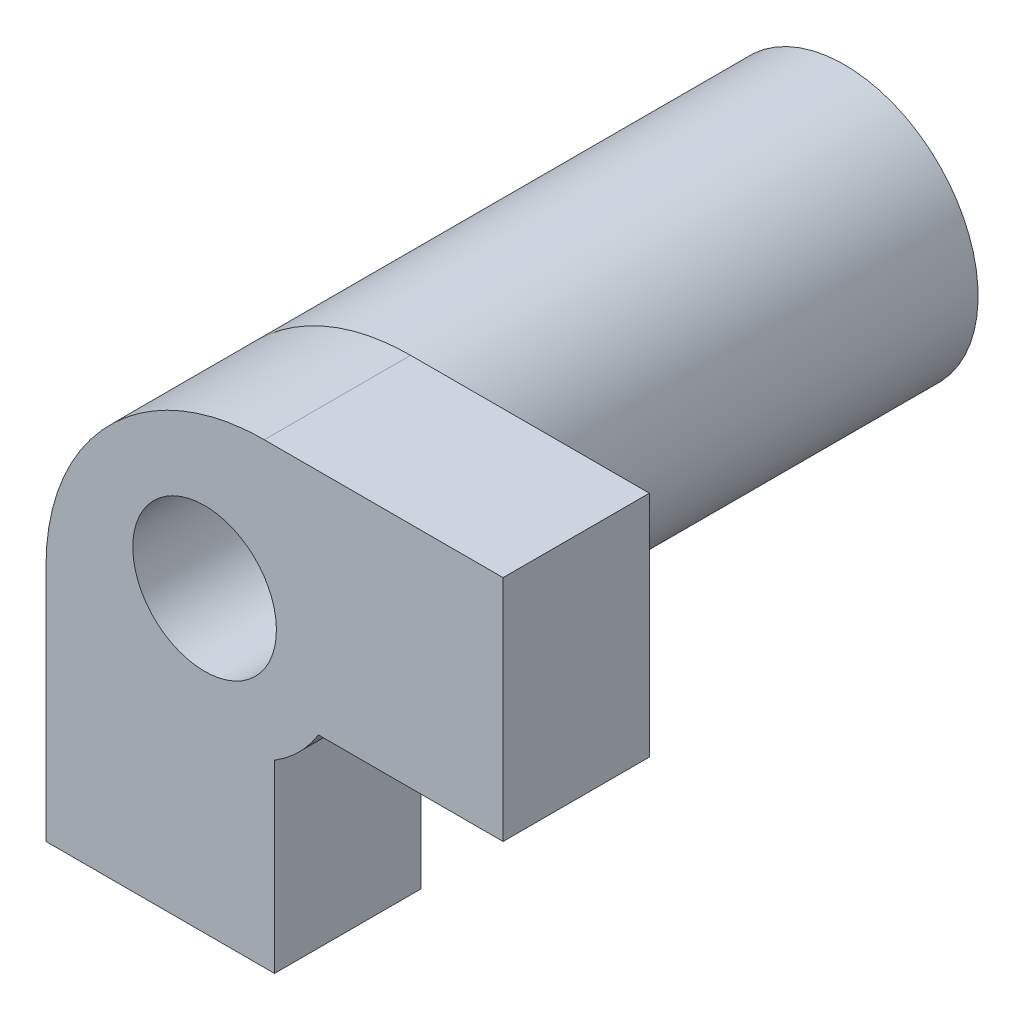
ISO-10303-21;
HEADER;
FILE_DESCRIPTION(('STEP AP214'),'2;1');
FILE_NAME('part.step','',(''),(''),'','','');
FILE_SCHEMA(('AUTOMOTIVE_DESIGN { 1 0 10303 214 1 1 1 1 }'));
ENDSEC;
DATA;
#1=APPLICATION_CONTEXT('core data for automotive mechanical design processes');
#2=APPLICATION_PROTOCOL_DEFINITION('international standard','automotive_design',2000,#1);
#3=PRODUCT_CONTEXT('',#1,'mechanical');
#4=PRODUCT('Part','Part','',(#3));
#5=PRODUCT_RELATED_PRODUCT_CATEGORY('part','',(#4));
#6=PRODUCT_DEFINITION_FORMATION('','',#4);
#7=PRODUCT_DEFINITION_CONTEXT('part definition',#1,'design');
#8=PRODUCT_DEFINITION('design','',#6,#7);
#9=PRODUCT_DEFINITION_SHAPE('','',#8);
#10=(LENGTH_UNIT() NAMED_UNIT(*) SI_UNIT(.MILLI.,.METRE.));
#11=(NAMED_UNIT(*) PLANE_ANGLE_UNIT() SI_UNIT($,.RADIAN.));
#12=(NAMED_UNIT(*) SI_UNIT($,.STERADIAN.) SOLID_ANGLE_UNIT());
#13=UNCERTAINTY_MEASURE_WITH_UNIT(LENGTH_MEASURE(1.E-05),#10,'distance_accuracy_value','');
#14=(GEOMETRIC_REPRESENTATION_CONTEXT(3) GLOBAL_UNCERTAINTY_ASSIGNED_CONTEXT((#13)) GLOBAL_UNIT_ASSIGNED_CONTEXT((#10,
#11,#12)) REPRESENTATION_CONTEXT('',''));
#15=CARTESIAN_POINT('',(0.,0.,0.));
#16=DIRECTION('',(0.,0.,1.));
#17=DIRECTION('',(1.,0.,0.));
#18=AXIS2_PLACEMENT_3D('',#15,#16,#17);
#19=CARTESIAN_POINT('',(0.,0.,0.));
#20=DIRECTION('',(0.,0.,1.));
#21=DIRECTION('',(1.,0.,0.));
#22=AXIS2_PLACEMENT_3D('',#19,#20,#21);
#23=PLANE('',#22);
#24=DIRECTION('',(0.,1.,0.));
#25=VECTOR('',#24,1.);
#26=CARTESIAN_POINT('',(6.54715186755524,0.,0.));
#27=LINE('',#26,#25);
#28=CARTESIAN_POINT('',(6.54715186755524,-1.53021253775997,0.));
#29=VERTEX_POINT('',#28);
#30=CARTESIAN_POINT('',(6.54715186755524,3.46978746224003,0.));
#31=VERTEX_POINT('',#30);
#32=EDGE_CURVE('E138',#29,#31,#27,.T.);
#33=ORIENTED_EDGE('',*,*,#32,.F.);
#34=DIRECTION('',(1.,0.,0.));
#35=VECTOR('',#34,1.);
#36=CARTESIAN_POINT('',(13.4404110884823,-1.53021253775997,0.));
#37=LINE('',#36,#35);
#38=CARTESIAN_POINT('',(2.50685643906458,-1.53021253775997,0.));
#39=VERTEX_POINT('',#38);
#40=EDGE_CURVE('E125',#39,#29,#37,.T.);
#41=ORIENTED_EDGE('',*,*,#40,.F.);
#42=CARTESIAN_POINT('',(0.0167410675553092,0.,0.));
#43=DIRECTION('',(0.,0.,-1.));
#44=DIRECTION('',(-1.,0.,0.));
#45=AXIS2_PLACEMENT_3D('',#42,#43,#44);
#46=CIRCLE('',#45,2.92270849968733);
#47=CARTESIAN_POINT('',(-2.05006791804164,2.06652500376846,0.));
#48=VERTEX_POINT('',#47);
#49=EDGE_CURVE('E137',#48,#39,#46,.T.);
#50=ORIENTED_EDGE('',*,*,#49,.F.);
#51=CARTESIAN_POINT('',(-3.45284813244476,-1.30644903047994,0.));
#52=CARTESIAN_POINT('',(-3.45284813244476,1.32052564952012,0.));
#53=CARTESIAN_POINT('',(-1.30348718860465,3.46978746224003,0.));
#54=CARTESIAN_POINT('',(1.32338836027532,3.46978746224003,0.));
#55=B_SPLINE_CURVE_WITH_KNOTS('',3,(#51,#52,#53,#54),.UNSPECIFIED.,.F.,.F.,(4,4),
(0.777777777777778,1.),.UNSPECIFIED.);
#56=CARTESIAN_POINT('',(1.32338836027532,3.46978746224003,0.));
#57=VERTEX_POINT('',#56);
#58=EDGE_CURVE('E91',#48,#57,#55,.T.);
#59=ORIENTED_EDGE('',*,*,#58,.T.);
#60=DIRECTION('',(1.,0.,0.));
#61=VECTOR('',#60,1.);
#62=CARTESIAN_POINT('',(0.,3.46978746224003,0.));
#63=LINE('',#62,#61);
#64=EDGE_CURVE('E160',#57,#31,#63,.T.);
#65=ORIENTED_EDGE('',*,*,#64,.T.);
#66=EDGE_LOOP('',(#33,#41,#50,#59,#65));
#67=FACE_BOUND('',#66,.T.);
#68=ADVANCED_FACE('F42',(#67),#23,.F.);
#69=CARTESIAN_POINT('',(-3.45284813244476,-1.30644903047994,3.2));
#70=CARTESIAN_POINT('',(-3.45284813244476,1.32052564952012,3.2));
#71=CARTESIAN_POINT('',(-1.30348718860465,3.46978746224003,3.2));
#72=CARTESIAN_POINT('',(1.32338836027532,3.46978746224003,3.2));
#73=B_SPLINE_CURVE_WITH_KNOTS('',3,(#69,#70,#71,#72),.UNSPECIFIED.,.F.,.F.,(4,4),
(0.777777777777778,1.),.UNSPECIFIED.);
#74=DIRECTION('',(0.,0.,-1.));
#75=VECTOR('',#74,1.);
#76=SURFACE_OF_LINEAR_EXTRUSION('',#73,#75);
#77=CARTESIAN_POINT('',(-3.45284813244476,-1.30644903047994,0.));
#78=VERTEX_POINT('',#77);
#79=EDGE_CURVE('E182',#78,#48,#55,.T.);
#80=ORIENTED_EDGE('',*,*,#79,.F.);
#81=DIRECTION('',(0.,0.,-1.));
#82=VECTOR('',#81,1.);
#83=CARTESIAN_POINT('',(-3.45284813244476,-1.30644903047994,3.2));
#84=LINE('',#83,#82);
#85=CARTESIAN_POINT('',(-3.45284813244476,-1.30644903047994,3.2));
#86=VERTEX_POINT('',#85);
#87=EDGE_CURVE('E11',#86,#78,#84,.T.);
#88=ORIENTED_EDGE('',*,*,#87,.F.);
#89=CARTESIAN_POINT('',(1.32338836027532,3.46978746224003,3.2));
#90=VERTEX_POINT('',#89);
#91=EDGE_CURVE('E153',#86,#90,#73,.T.);
#92=ORIENTED_EDGE('',*,*,#91,.T.);
#93=DIRECTION('',(0.,0.,-1.));
#94=VECTOR('',#93,1.);
#95=CARTESIAN_POINT('',(1.32338836027532,3.46978746224003,3.2));
#96=LINE('',#95,#94);
#97=EDGE_CURVE('E69',#90,#57,#96,.T.);
#98=ORIENTED_EDGE('',*,*,#97,.T.);
#99=ORIENTED_EDGE('',*,*,#58,.F.);
#100=EDGE_LOOP('',(#80,#88,#92,#98,#99));
#101=FACE_BOUND('',#100,.T.);
#102=ADVANCED_FACE('F44',(#101),#76,.T.);
#103=CARTESIAN_POINT('',(-3.45284813244476,0.,3.2));
#104=DIRECTION('',(-1.,0.,0.));
#105=DIRECTION('',(0.,0.,1.));
#106=AXIS2_PLACEMENT_3D('',#103,#104,#105);
#107=PLANE('',#106);
#108=DIRECTION('',(0.,1.,0.));
#109=VECTOR('',#108,1.);
#110=CARTESIAN_POINT('',(-3.45284813244476,0.,0.));
#111=LINE('',#110,#109);
#112=CARTESIAN_POINT('',(-3.45284813244476,-6.53021253775997,0.));
#113=VERTEX_POINT('',#112);
#114=EDGE_CURVE('E231',#113,#78,#111,.T.);
#115=ORIENTED_EDGE('',*,*,#114,.F.);
#116=DIRECTION('',(0.,0.,-1.));
#117=VECTOR('',#116,1.);
#118=CARTESIAN_POINT('',(-3.45284813244476,-6.53021253775997,3.2));
#119=LINE('',#118,#117);
#120=CARTESIAN_POINT('',(-3.45284813244476,-6.53021253775997,3.2));
#121=VERTEX_POINT('',#120);
#122=EDGE_CURVE('E53',#121,#113,#119,.T.);
#123=ORIENTED_EDGE('',*,*,#122,.F.);
#124=DIRECTION('',(0.,1.,0.));
#125=VECTOR('',#124,1.);
#126=CARTESIAN_POINT('',(-3.45284813244476,0.,3.2));
#127=LINE('',#126,#125);
#128=EDGE_CURVE('E159',#121,#86,#127,.T.);
#129=ORIENTED_EDGE('',*,*,#128,.T.);
#130=ORIENTED_EDGE('',*,*,#87,.T.);
#131=EDGE_LOOP('',(#115,#123,#129,#130));
#132=FACE_BOUND('',#131,.T.);
#133=ADVANCED_FACE('F204',(#132),#107,.T.);
#134=CARTESIAN_POINT('',(0.,-6.53021253775997,3.2));
#135=DIRECTION('',(0.,1.,0.));
#136=DIRECTION('',(-1.,0.,0.));
#137=AXIS2_PLACEMENT_3D('',#134,#135,#136);
#138=PLANE('',#137);
#139=DIRECTION('',(1.,0.,0.));
#140=VECTOR('',#139,1.);
#141=CARTESIAN_POINT('',(0.,-6.53021253775997,0.));
#142=LINE('',#141,#140);
#143=CARTESIAN_POINT('',(1.54715186755524,-6.53021253775997,0.));
#144=VERTEX_POINT('',#143);
#145=EDGE_CURVE('E236',#113,#144,#142,.T.);
#146=ORIENTED_EDGE('',*,*,#145,.T.);
#147=DIRECTION('',(0.,0.,1.));
#148=VECTOR('',#147,1.);
#149=CARTESIAN_POINT('',(1.54715186755524,-6.53021253775997,3.2));
#150=LINE('',#149,#148);
#151=CARTESIAN_POINT('',(1.54715186755524,-6.53021253775997,3.2));
#152=VERTEX_POINT('',#151);
#153=EDGE_CURVE('E270',#144,#152,#150,.T.);
#154=ORIENTED_EDGE('',*,*,#153,.T.);
#155=DIRECTION('',(1.,0.,0.));
#156=VECTOR('',#155,1.);
#157=CARTESIAN_POINT('',(0.,-6.53021253775997,3.2));
#158=LINE('',#157,#156);
#159=EDGE_CURVE('E167',#121,#152,#158,.T.);
#160=ORIENTED_EDGE('',*,*,#159,.F.);
#161=ORIENTED_EDGE('',*,*,#122,.T.);
#162=EDGE_LOOP('',(#146,#154,#160,#161));
#163=FACE_BOUND('',#162,.T.);
#164=ADVANCED_FACE('F201',(#163),#138,.F.);
#165=CARTESIAN_POINT('',(6.54715186755524,0.,3.2));
#166=DIRECTION('',(-1.,0.,0.));
#167=DIRECTION('',(0.,-1.,0.));
#168=AXIS2_PLACEMENT_3D('',#165,#166,#167);
#169=PLANE('',#168);
#170=DIRECTION('',(0.,1.,0.));
#171=VECTOR('',#170,1.);
#172=CARTESIAN_POINT('',(6.54715186755524,0.,3.2));
#173=LINE('',#172,#171);
#174=CARTESIAN_POINT('',(6.54715186755524,-1.53021253775997,3.2));
#175=VERTEX_POINT('',#174);
#176=CARTESIAN_POINT('',(6.54715186755524,3.46978746224003,3.2));
#177=VERTEX_POINT('',#176);
#178=EDGE_CURVE('E171',#175,#177,#173,.T.);
#179=ORIENTED_EDGE('',*,*,#178,.F.);
#180=DIRECTION('',(0.,0.,-1.));
#181=VECTOR('',#180,1.);
#182=CARTESIAN_POINT('',(6.54715186755524,-1.53021253775997,3.2));
#183=LINE('',#182,#181);
#184=EDGE_CURVE('E258',#175,#29,#183,.T.);
#185=ORIENTED_EDGE('',*,*,#184,.T.);
#186=ORIENTED_EDGE('',*,*,#32,.T.);
#187=DIRECTION('',(0.,0.,-1.));
#188=VECTOR('',#187,1.);
#189=CARTESIAN_POINT('',(6.54715186755524,3.46978746224003,3.2));
#190=LINE('',#189,#188);
#191=EDGE_CURVE('E244',#177,#31,#190,.T.);
#192=ORIENTED_EDGE('',*,*,#191,.F.);
#193=EDGE_LOOP('',(#179,#185,#186,#192));
#194=FACE_BOUND('',#193,.T.);
#195=ADVANCED_FACE('F198',(#194),#169,.F.);
#196=CARTESIAN_POINT('',(0.,3.46978746224003,3.2));
#197=DIRECTION('',(0.,1.,0.));
#198=DIRECTION('',(0.,0.,1.));
#199=AXIS2_PLACEMENT_3D('',#196,#197,#198);
#200=PLANE('',#199);
#201=ORIENTED_EDGE('',*,*,#64,.F.);
#202=ORIENTED_EDGE('',*,*,#97,.F.);
#203=DIRECTION('',(1.,0.,0.));
#204=VECTOR('',#203,1.);
#205=CARTESIAN_POINT('',(0.,3.46978746224003,3.2));
#206=LINE('',#205,#204);
#207=EDGE_CURVE('E174',#90,#177,#206,.T.);
#208=ORIENTED_EDGE('',*,*,#207,.T.);
#209=ORIENTED_EDGE('',*,*,#191,.T.);
#210=EDGE_LOOP('',(#201,#202,#208,#209));
#211=FACE_BOUND('',#210,.T.);
#212=ADVANCED_FACE('F192',(#211),#200,.T.);
#213=CARTESIAN_POINT('',(0.0167410675553092,0.,3.2));
#214=DIRECTION('',(0.,0.,1.));
#215=DIRECTION('',(0.,1.,0.));
#216=AXIS2_PLACEMENT_3D('',#213,#214,#215);
#217=ELLIPSE('',#216,1.57122825200018,1.57122825199996);
#218=DIRECTION('',(0.,0.,-1.));
#219=VECTOR('',#218,1.);
#220=SURFACE_OF_LINEAR_EXTRUSION('',#217,#219);
#221=CARTESIAN_POINT('',(0.0167410675553092,1.57122825200018,3.2));
#222=VERTEX_POINT('',#221);
#223=EDGE_CURVE('E177',#222,#222,#217,.T.);
#224=ORIENTED_EDGE('',*,*,#223,.T.);
#225=EDGE_LOOP('',(#224));
#226=FACE_BOUND('',#225,.T.);
#227=CARTESIAN_POINT('',(0.0167410675553092,0.,0.));
#228=DIRECTION('',(0.,0.,1.));
#229=DIRECTION('',(1.,0.,0.));
#230=AXIS2_PLACEMENT_3D('',#227,#228,#229);
#231=CIRCLE('',#230,1.57122825200018);
#232=CARTESIAN_POINT('',(1.58796931955549,0.,0.));
#233=VERTEX_POINT('',#232);
#234=EDGE_CURVE('E260',#233,#233,#231,.T.);
#235=ORIENTED_EDGE('',*,*,#234,.F.);
#236=EDGE_LOOP('',(#235));
#237=FACE_BOUND('',#236,.T.);
#238=ADVANCED_FACE('F187',(#226,#237),#220,.T.);
#239=CARTESIAN_POINT('',(0.,0.,3.2));
#240=DIRECTION('',(0.,0.,1.));
#241=DIRECTION('',(1.,0.,0.));
#242=AXIS2_PLACEMENT_3D('',#239,#240,#241);
#243=PLANE('',#242);
#244=DIRECTION('',(-1.,0.,0.));
#245=VECTOR('',#244,1.);
#246=CARTESIAN_POINT('',(0.,-1.53021253775997,3.2));
#247=LINE('',#246,#245);
#248=CARTESIAN_POINT('',(2.50685643906458,-1.53021253775997,3.2));
#249=VERTEX_POINT('',#248);
#250=EDGE_CURVE('E128',#175,#249,#247,.T.);
#251=ORIENTED_EDGE('',*,*,#250,.F.);
#252=ORIENTED_EDGE('',*,*,#178,.T.);
#253=ORIENTED_EDGE('',*,*,#207,.F.);
#254=ORIENTED_EDGE('',*,*,#91,.F.);
#255=ORIENTED_EDGE('',*,*,#128,.F.);
#256=ORIENTED_EDGE('',*,*,#159,.T.);
#257=DIRECTION('',(0.,-1.,0.));
#258=VECTOR('',#257,1.);
#259=CARTESIAN_POINT('',(1.54715186755524,0.,3.2));
#260=LINE('',#259,#258);
#261=CARTESIAN_POINT('',(1.54715186755524,-2.48999352557153,3.2));
#262=VERTEX_POINT('',#261);
#263=EDGE_CURVE('E133',#262,#152,#260,.T.);
#264=ORIENTED_EDGE('',*,*,#263,.F.);
#265=CARTESIAN_POINT('',(0.0167410675553092,0.,3.2));
#266=DIRECTION('',(0.,0.,1.));
#267=DIRECTION('',(1.,0.,0.));
#268=AXIS2_PLACEMENT_3D('',#265,#266,#267);
#269=CIRCLE('',#268,2.92270849968733);
#270=EDGE_CURVE('E265',#249,#262,#269,.F.);
#271=ORIENTED_EDGE('',*,*,#270,.F.);
#272=EDGE_LOOP('',(#251,#252,#253,#254,#255,#256,#264,#271));
#273=FACE_BOUND('',#272,.T.);
#274=ORIENTED_EDGE('',*,*,#223,.F.);
#275=EDGE_LOOP('',(#274));
#276=FACE_BOUND('',#275,.T.);
#277=ADVANCED_FACE('F191',(#273,#276),#243,.T.);
#278=CARTESIAN_POINT('',(1.54715186755524,-2.48999352557153,0.));
#279=VERTEX_POINT('',#278);
#280=EDGE_CURVE('E143',#279,#48,#46,.T.);
#281=ORIENTED_EDGE('',*,*,#280,.F.);
#282=DIRECTION('',(0.,1.,0.));
#283=VECTOR('',#282,1.);
#284=CARTESIAN_POINT('',(1.54715186755524,-13.3705344544035,0.));
#285=LINE('',#284,#283);
#286=EDGE_CURVE('E60',#144,#279,#285,.T.);
#287=ORIENTED_EDGE('',*,*,#286,.F.);
#288=ORIENTED_EDGE('',*,*,#145,.F.);
#289=ORIENTED_EDGE('',*,*,#114,.T.);
#290=ORIENTED_EDGE('',*,*,#79,.T.);
#291=EDGE_LOOP('',(#281,#287,#288,#289,#290));
#292=FACE_BOUND('',#291,.T.);
#293=ADVANCED_FACE('F194',(#292),#23,.F.);
#294=CARTESIAN_POINT('',(0.0167410675553092,0.,-10.8));
#295=DIRECTION('',(0.,0.,-1.));
#296=DIRECTION('',(-1.,0.,0.));
#297=AXIS2_PLACEMENT_3D('',#294,#295,#296);
#298=PLANE('',#297);
#299=CARTESIAN_POINT('',(0.0167410675553092,0.,-10.8));
#300=DIRECTION('',(0.,0.,-1.));
#301=DIRECTION('',(-1.,0.,0.));
#302=AXIS2_PLACEMENT_3D('',#299,#300,#301);
#303=CIRCLE('',#302,1.57122825200018);
#304=CARTESIAN_POINT('',(-1.55448718444487,0.,-10.8));
#305=VERTEX_POINT('',#304);
#306=EDGE_CURVE('E47',#305,#305,#303,.T.);
#307=ORIENTED_EDGE('',*,*,#306,.F.);
#308=EDGE_LOOP('',(#307));
#309=FACE_BOUND('',#308,.T.);
#310=CARTESIAN_POINT('',(0.0167410675553092,0.,-10.8));
#311=DIRECTION('',(0.,0.,-1.));
#312=DIRECTION('',(-1.,0.,0.));
#313=AXIS2_PLACEMENT_3D('',#310,#311,#312);
#314=CIRCLE('',#313,2.92270849968733);
#315=CARTESIAN_POINT('',(-2.90596743213202,0.,-10.8));
#316=VERTEX_POINT('',#315);
#317=EDGE_CURVE('E146',#316,#316,#314,.T.);
#318=ORIENTED_EDGE('',*,*,#317,.T.);
#319=EDGE_LOOP('',(#318));
#320=FACE_BOUND('',#319,.T.);
#321=ADVANCED_FACE('F218',(#309,#320),#298,.T.);
#322=CARTESIAN_POINT('',(0.0167410675553092,0.,-10.8));
#323=DIRECTION('',(0.,0.,1.));
#324=DIRECTION('',(1.,0.,0.));
#325=AXIS2_PLACEMENT_3D('',#322,#323,#324);
#326=CYLINDRICAL_SURFACE('',#325,2.92270849968733);
#327=ORIENTED_EDGE('',*,*,#317,.F.);
#328=EDGE_LOOP('',(#327));
#329=FACE_BOUND('',#328,.T.);
#330=ORIENTED_EDGE('',*,*,#49,.T.);
#331=DIRECTION('',(0.,0.,-1.));
#332=VECTOR('',#331,1.);
#333=CARTESIAN_POINT('',(2.50685643906458,-1.53021253775997,13.8));
#334=LINE('',#333,#332);
#335=EDGE_CURVE('E122',#249,#39,#334,.T.);
#336=ORIENTED_EDGE('',*,*,#335,.F.);
#337=ORIENTED_EDGE('',*,*,#270,.T.);
#338=DIRECTION('',(0.,0.,-1.));
#339=VECTOR('',#338,1.);
#340=CARTESIAN_POINT('',(1.54715186755524,-2.48999352557153,13.8));
#341=LINE('',#340,#339);
#342=EDGE_CURVE('E134',#262,#279,#341,.T.);
#343=ORIENTED_EDGE('',*,*,#342,.T.);
#344=ORIENTED_EDGE('',*,*,#280,.T.);
#345=EDGE_LOOP('',(#330,#336,#337,#343,#344));
#346=FACE_BOUND('',#345,.T.);
#347=ADVANCED_FACE('F141',(#329,#346),#326,.T.);
#348=CARTESIAN_POINT('',(0.0167410675553092,0.,-13.8));
#349=DIRECTION('',(0.,0.,1.));
#350=DIRECTION('',(1.,0.,0.));
#351=AXIS2_PLACEMENT_3D('',#348,#349,#350);
#352=CYLINDRICAL_SURFACE('',#351,1.57122825200018);
#353=ORIENTED_EDGE('',*,*,#306,.T.);
#354=EDGE_LOOP('',(#353));
#355=FACE_BOUND('',#354,.T.);
#356=ORIENTED_EDGE('',*,*,#234,.T.);
#357=EDGE_LOOP('',(#356));
#358=FACE_BOUND('',#357,.T.);
#359=ADVANCED_FACE('F284',(#355,#358),#352,.F.);
#360=CARTESIAN_POINT('',(13.4404110884823,-1.53021253775997,13.8));
#361=DIRECTION('',(0.,1.,0.));
#362=DIRECTION('',(0.,0.,1.));
#363=AXIS2_PLACEMENT_3D('',#360,#361,#362);
#364=PLANE('',#363);
#365=ORIENTED_EDGE('',*,*,#250,.T.);
#366=ORIENTED_EDGE('',*,*,#335,.T.);
#367=ORIENTED_EDGE('',*,*,#40,.T.);
#368=ORIENTED_EDGE('',*,*,#184,.F.);
#369=EDGE_LOOP('',(#365,#366,#367,#368));
#370=FACE_BOUND('',#369,.T.);
#371=ADVANCED_FACE('F124',(#370),#364,.F.);
#372=CARTESIAN_POINT('',(1.54715186755524,-13.3705344544035,13.8));
#373=DIRECTION('',(-1.,0.,0.));
#374=DIRECTION('',(0.,0.,1.));
#375=AXIS2_PLACEMENT_3D('',#372,#373,#374);
#376=PLANE('',#375);
#377=ORIENTED_EDGE('',*,*,#286,.T.);
#378=ORIENTED_EDGE('',*,*,#342,.F.);
#379=ORIENTED_EDGE('',*,*,#263,.T.);
#380=ORIENTED_EDGE('',*,*,#153,.F.);
#381=EDGE_LOOP('',(#377,#378,#379,#380));
#382=FACE_BOUND('',#381,.T.);
#383=ADVANCED_FACE('F278',(#382),#376,.F.);
#384=CLOSED_SHELL('',(#68,#102,#133,#164,#195,#212,#238,#277,#293,#321,#347,#359,#371,#383));
#385=MANIFOLD_SOLID_BREP('B2',#384);
#386=ADVANCED_BREP_SHAPE_REPRESENTATION('',(#18,#385),#14);
#387=SHAPE_DEFINITION_REPRESENTATION(#9,#386);
ENDSEC;
END-ISO-10303-21;
